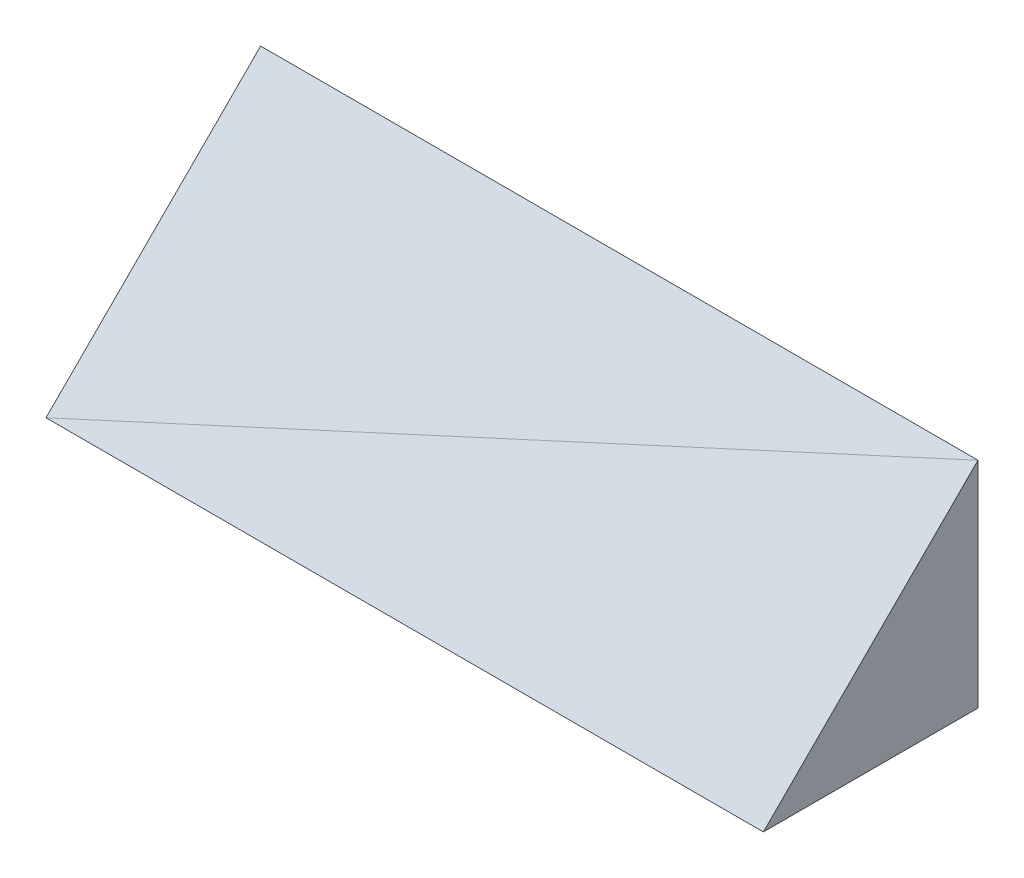
ISO-10303-21;
HEADER;
FILE_DESCRIPTION(('STEP AP214'),'2;1');
FILE_NAME('part.step','',(''),(''),'','','');
FILE_SCHEMA(('AUTOMOTIVE_DESIGN { 1 0 10303 214 1 1 1 1 }'));
ENDSEC;
DATA;
#1=APPLICATION_CONTEXT('core data for automotive mechanical design processes');
#2=APPLICATION_PROTOCOL_DEFINITION('international standard','automotive_design',2000,#1);
#3=PRODUCT_CONTEXT('',#1,'mechanical');
#4=PRODUCT('Part','Part','',(#3));
#5=PRODUCT_RELATED_PRODUCT_CATEGORY('part','',(#4));
#6=PRODUCT_DEFINITION_FORMATION('','',#4);
#7=PRODUCT_DEFINITION_CONTEXT('part definition',#1,'design');
#8=PRODUCT_DEFINITION('design','',#6,#7);
#9=PRODUCT_DEFINITION_SHAPE('','',#8);
#10=(LENGTH_UNIT() NAMED_UNIT(*) SI_UNIT(.MILLI.,.METRE.));
#11=(NAMED_UNIT(*) PLANE_ANGLE_UNIT() SI_UNIT($,.RADIAN.));
#12=(NAMED_UNIT(*) SI_UNIT($,.STERADIAN.) SOLID_ANGLE_UNIT());
#13=UNCERTAINTY_MEASURE_WITH_UNIT(LENGTH_MEASURE(1.E-05),#10,'distance_accuracy_value','');
#14=(GEOMETRIC_REPRESENTATION_CONTEXT(3) GLOBAL_UNCERTAINTY_ASSIGNED_CONTEXT((#13)) GLOBAL_UNIT_ASSIGNED_CONTEXT((#10,
#11,#12)) REPRESENTATION_CONTEXT('',''));
#15=CARTESIAN_POINT('',(0.,0.,0.));
#16=DIRECTION('',(0.,0.,1.));
#17=DIRECTION('',(1.,0.,0.));
#18=AXIS2_PLACEMENT_3D('',#15,#16,#17);
#19=CARTESIAN_POINT('',(119.999997317791,0.,0.));
#20=DIRECTION('',(1.,0.,0.));
#21=DIRECTION('',(0.,0.,-1.));
#22=AXIS2_PLACEMENT_3D('',#19,#20,#21);
#23=PLANE('',#22);
#24=DIRECTION('',(0.,0.,1.));
#25=VECTOR('',#24,1.);
#26=CARTESIAN_POINT('',(119.999997317791,0.,0.));
#27=LINE('',#26,#25);
#28=CARTESIAN_POINT('',(119.999997317791,0.,0.));
#29=VERTEX_POINT('',#28);
#30=CARTESIAN_POINT('',(119.999997317791,0.,35.9000004827976));
#31=VERTEX_POINT('',#30);
#32=EDGE_CURVE('E55',#29,#31,#27,.T.);
#33=ORIENTED_EDGE('',*,*,#32,.F.);
#34=DIRECTION('',(0.,-1.,0.));
#35=VECTOR('',#34,1.);
#36=CARTESIAN_POINT('',(119.999997317791,35.9000004827976,1.23145937976126E-13));
#37=LINE('',#36,#35);
#38=CARTESIAN_POINT('',(119.999997317791,35.9000004827976,1.20982390835712E-13));
#39=VERTEX_POINT('',#38);
#40=EDGE_CURVE('E19',#39,#29,#37,.T.);
#41=ORIENTED_EDGE('',*,*,#40,.F.);
#42=DIRECTION('',(0.,0.707106781186549,-0.707106781186546));
#43=VECTOR('',#42,1.);
#44=CARTESIAN_POINT('',(119.999997317791,0.,35.9000004827976));
#45=LINE('',#44,#43);
#46=EDGE_CURVE('E53',#31,#39,#45,.T.);
#47=ORIENTED_EDGE('',*,*,#46,.F.);
#48=EDGE_LOOP('',(#33,#41,#47));
#49=FACE_BOUND('',#48,.T.);
#50=ADVANCED_FACE('F16',(#49),#23,.T.);
#51=CARTESIAN_POINT('',(0.,0.,0.));
#52=DIRECTION('',(0.,0.,1.));
#53=DIRECTION('',(0.,-1.,0.));
#54=AXIS2_PLACEMENT_3D('',#51,#52,#53);
#55=PLANE('',#54);
#56=ORIENTED_EDGE('',*,*,#40,.T.);
#57=DIRECTION('',(0.958045737612122,-0.286615360096497,0.));
#58=VECTOR('',#57,1.);
#59=CARTESIAN_POINT('',(0.,35.9000004827976,1.23145937976126E-13));
#60=LINE('',#59,#58);
#61=CARTESIAN_POINT('',(0.,35.9000004827976,1.22288290647251E-13));
#62=VERTEX_POINT('',#61);
#63=EDGE_CURVE('E49',#62,#29,#60,.T.);
#64=ORIENTED_EDGE('',*,*,#63,.F.);
#65=DIRECTION('',(-1.,0.,0.));
#66=VECTOR('',#65,1.);
#67=CARTESIAN_POINT('',(119.999997317791,35.9000004827976,1.17961196366423E-13));
#68=LINE('',#67,#66);
#69=EDGE_CURVE('E56',#39,#62,#68,.T.);
#70=ORIENTED_EDGE('',*,*,#69,.F.);
#71=EDGE_LOOP('',(#56,#64,#70));
#72=FACE_BOUND('',#71,.T.);
#73=ADVANCED_FACE('F57',(#72),#55,.F.);
#74=CARTESIAN_POINT('',(0.,17.9500002413988,17.9500002413989));
#75=DIRECTION('',(0.,-0.707106781186546,-0.707106781186549));
#76=DIRECTION('',(0.,0.707106781186549,-0.707106781186546));
#77=AXIS2_PLACEMENT_3D('',#74,#75,#76);
#78=PLANE('',#77);
#79=ORIENTED_EDGE('',*,*,#46,.T.);
#80=DIRECTION('',(0.920964392528434,0.275521857295145,-0.275521857295144));
#81=VECTOR('',#80,1.);
#82=CARTESIAN_POINT('',(0.,0.,35.9000004827976));
#83=LINE('',#82,#81);
#84=CARTESIAN_POINT('',(0.,0.,35.9000004827976));
#85=VERTEX_POINT('',#84);
#86=EDGE_CURVE('E62',#85,#39,#83,.T.);
#87=ORIENTED_EDGE('',*,*,#86,.F.);
#88=DIRECTION('',(-1.,0.,0.));
#89=VECTOR('',#88,1.);
#90=CARTESIAN_POINT('',(119.999997317791,0.,35.9000004827976));
#91=LINE('',#90,#89);
#92=EDGE_CURVE('E34',#31,#85,#91,.T.);
#93=ORIENTED_EDGE('',*,*,#92,.F.);
#94=EDGE_LOOP('',(#79,#87,#93));
#95=FACE_BOUND('',#94,.T.);
#96=ADVANCED_FACE('F64',(#95),#78,.F.);
#97=CARTESIAN_POINT('',(0.,17.9500002413988,17.9500002413989));
#98=DIRECTION('',(0.,0.707106781186546,0.707106781186549));
#99=DIRECTION('',(0.,-0.707106781186549,0.707106781186546));
#100=AXIS2_PLACEMENT_3D('',#97,#98,#99);
#101=PLANE('',#100);
#102=ORIENTED_EDGE('',*,*,#69,.T.);
#103=DIRECTION('',(0.,0.707106781186549,-0.707106781186546));
#104=VECTOR('',#103,1.);
#105=CARTESIAN_POINT('',(0.,0.,35.9000004827976));
#106=LINE('',#105,#104);
#107=EDGE_CURVE('E68',#85,#62,#106,.T.);
#108=ORIENTED_EDGE('',*,*,#107,.F.);
#109=ORIENTED_EDGE('',*,*,#86,.T.);
#110=EDGE_LOOP('',(#102,#108,#109));
#111=FACE_BOUND('',#110,.T.);
#112=ADVANCED_FACE('F66',(#111),#101,.T.);
#113=CARTESIAN_POINT('',(0.,0.,0.));
#114=DIRECTION('',(0.,0.,-1.));
#115=DIRECTION('',(0.,1.,0.));
#116=AXIS2_PLACEMENT_3D('',#113,#114,#115);
#117=PLANE('',#116);
#118=DIRECTION('',(1.,0.,0.));
#119=VECTOR('',#118,1.);
#120=CARTESIAN_POINT('',(0.,0.,0.));
#121=LINE('',#120,#119);
#122=CARTESIAN_POINT('',(0.,0.,0.));
#123=VERTEX_POINT('',#122);
#124=EDGE_CURVE('E74',#123,#29,#121,.T.);
#125=ORIENTED_EDGE('',*,*,#124,.F.);
#126=DIRECTION('',(0.,-1.,0.));
#127=VECTOR('',#126,1.);
#128=CARTESIAN_POINT('',(0.,35.9000004827976,1.23145937976126E-13));
#129=LINE('',#128,#127);
#130=EDGE_CURVE('E70',#62,#123,#129,.T.);
#131=ORIENTED_EDGE('',*,*,#130,.F.);
#132=ORIENTED_EDGE('',*,*,#63,.T.);
#133=EDGE_LOOP('',(#125,#131,#132));
#134=FACE_BOUND('',#133,.T.);
#135=ADVANCED_FACE('F90',(#134),#117,.T.);
#136=CARTESIAN_POINT('',(0.,0.,0.));
#137=DIRECTION('',(1.,0.,0.));
#138=DIRECTION('',(0.,0.,-1.));
#139=AXIS2_PLACEMENT_3D('',#136,#137,#138);
#140=PLANE('',#139);
#141=DIRECTION('',(0.,0.,-1.));
#142=VECTOR('',#141,1.);
#143=CARTESIAN_POINT('',(0.,0.,35.9000004827976));
#144=LINE('',#143,#142);
#145=EDGE_CURVE('E25',#85,#123,#144,.T.);
#146=ORIENTED_EDGE('',*,*,#145,.F.);
#147=ORIENTED_EDGE('',*,*,#107,.T.);
#148=ORIENTED_EDGE('',*,*,#130,.T.);
#149=EDGE_LOOP('',(#146,#147,#148));
#150=FACE_BOUND('',#149,.T.);
#151=ADVANCED_FACE('F86',(#150),#140,.F.);
#152=CARTESIAN_POINT('',(0.,0.,0.));
#153=DIRECTION('',(0.,1.,0.));
#154=DIRECTION('',(0.,0.,1.));
#155=AXIS2_PLACEMENT_3D('',#152,#153,#154);
#156=PLANE('',#155);
#157=ORIENTED_EDGE('',*,*,#32,.T.);
#158=DIRECTION('',(0.958045737612122,0.,0.286615360096497));
#159=VECTOR('',#158,1.);
#160=CARTESIAN_POINT('',(0.,0.,0.));
#161=LINE('',#160,#159);
#162=EDGE_CURVE('E10',#123,#31,#161,.T.);
#163=ORIENTED_EDGE('',*,*,#162,.F.);
#164=ORIENTED_EDGE('',*,*,#124,.T.);
#165=EDGE_LOOP('',(#157,#163,#164));
#166=FACE_BOUND('',#165,.T.);
#167=ADVANCED_FACE('F89',(#166),#156,.F.);
#168=CARTESIAN_POINT('',(0.,0.,0.));
#169=DIRECTION('',(0.,-1.,0.));
#170=DIRECTION('',(0.,0.,-1.));
#171=AXIS2_PLACEMENT_3D('',#168,#169,#170);
#172=PLANE('',#171);
#173=ORIENTED_EDGE('',*,*,#92,.T.);
#174=ORIENTED_EDGE('',*,*,#145,.T.);
#175=ORIENTED_EDGE('',*,*,#162,.T.);
#176=EDGE_LOOP('',(#173,#174,#175));
#177=FACE_BOUND('',#176,.T.);
#178=ADVANCED_FACE('F83',(#177),#172,.T.);
#179=CLOSED_SHELL('',(#50,#73,#96,#112,#135,#151,#167,#178));
#180=MANIFOLD_SOLID_BREP('B1',#179);
#181=ADVANCED_BREP_SHAPE_REPRESENTATION('',(#18,#180),#14);
#182=SHAPE_DEFINITION_REPRESENTATION(#9,#181);
ENDSEC;
END-ISO-10303-21;
